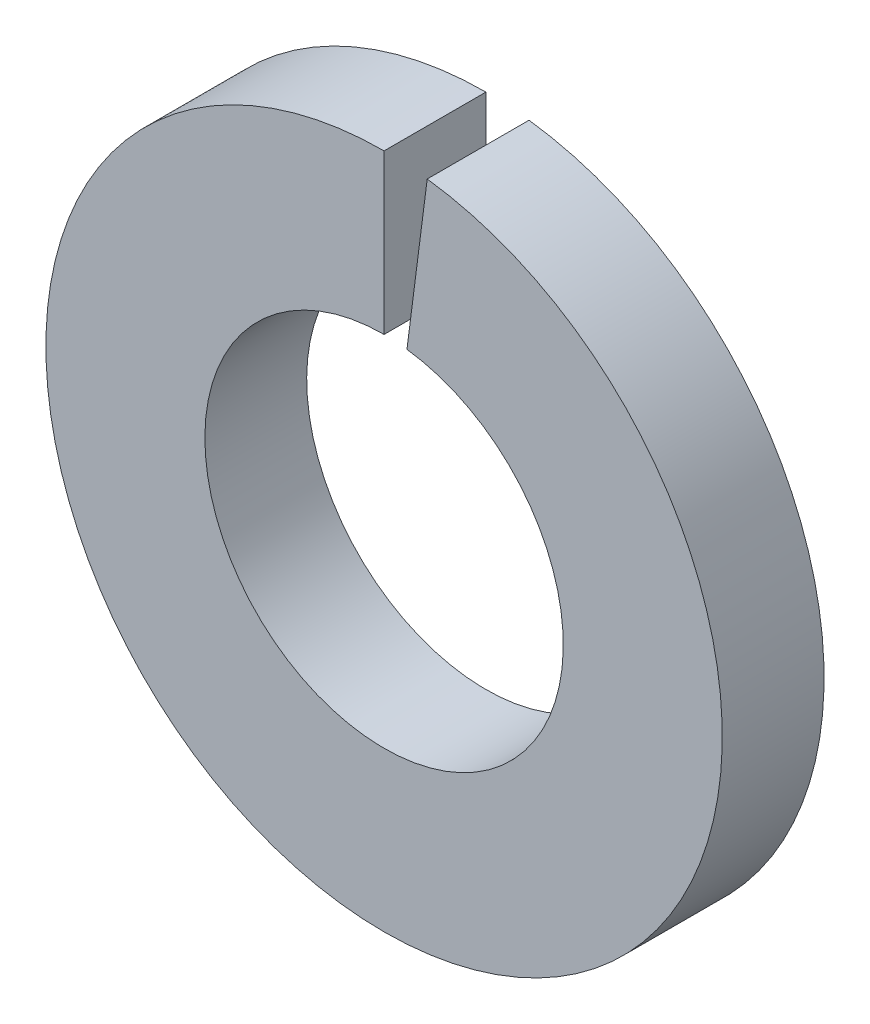
ISO-10303-21;
HEADER;
FILE_DESCRIPTION(('STEP AP214'),'2;1');
FILE_NAME('part.step','',(''),(''),'','','');
FILE_SCHEMA(('AUTOMOTIVE_DESIGN { 1 0 10303 214 1 1 1 1 }'));
ENDSEC;
DATA;
#1=APPLICATION_CONTEXT('core data for automotive mechanical design processes');
#2=APPLICATION_PROTOCOL_DEFINITION('international standard','automotive_design',2000,#1);
#3=PRODUCT_CONTEXT('',#1,'mechanical');
#4=PRODUCT('Part','Part','',(#3));
#5=PRODUCT_RELATED_PRODUCT_CATEGORY('part','',(#4));
#6=PRODUCT_DEFINITION_FORMATION('','',#4);
#7=PRODUCT_DEFINITION_CONTEXT('part definition',#1,'design');
#8=PRODUCT_DEFINITION('design','',#6,#7);
#9=PRODUCT_DEFINITION_SHAPE('','',#8);
#10=(LENGTH_UNIT() NAMED_UNIT(*) SI_UNIT(.MILLI.,.METRE.));
#11=(NAMED_UNIT(*) PLANE_ANGLE_UNIT() SI_UNIT($,.RADIAN.));
#12=(NAMED_UNIT(*) SI_UNIT($,.STERADIAN.) SOLID_ANGLE_UNIT());
#13=UNCERTAINTY_MEASURE_WITH_UNIT(LENGTH_MEASURE(1.E-05),#10,'distance_accuracy_value','');
#14=(GEOMETRIC_REPRESENTATION_CONTEXT(3) GLOBAL_UNCERTAINTY_ASSIGNED_CONTEXT((#13)) GLOBAL_UNIT_ASSIGNED_CONTEXT((#10,
#11,#12)) REPRESENTATION_CONTEXT('',''));
#15=CARTESIAN_POINT('',(0.,0.,0.));
#16=DIRECTION('',(0.,0.,1.));
#17=DIRECTION('',(1.,0.,0.));
#18=AXIS2_PLACEMENT_3D('',#15,#16,#17);
#19=CARTESIAN_POINT('',(0.,0.,1.8542));
#20=DIRECTION('',(0.,0.,1.));
#21=DIRECTION('',(1.,0.,0.));
#22=AXIS2_PLACEMENT_3D('',#19,#20,#21);
#23=PLANE('',#22);
#24=DIRECTION('',(0.127599136443187,0.991825821593163,0.));
#25=VECTOR('',#24,1.);
#26=CARTESIAN_POINT('',(0.,0.,1.8542));
#27=LINE('',#26,#25);
#28=CARTESIAN_POINT('',(0.416470821436917,3.23722029909792,1.8542));
#29=VERTEX_POINT('',#28);
#30=CARTESIAN_POINT('',(0.785946880921808,6.10915114810309,1.8542));
#31=VERTEX_POINT('',#30);
#32=EDGE_CURVE('E80',#29,#31,#27,.T.);
#33=ORIENTED_EDGE('',*,*,#32,.F.);
#34=CARTESIAN_POINT('',(0.,0.,1.8542));
#35=DIRECTION('',(0.,0.,1.));
#36=DIRECTION('',(1.,0.,0.));
#37=AXIS2_PLACEMENT_3D('',#34,#35,#36);
#38=CIRCLE('',#37,3.2639);
#39=CARTESIAN_POINT('',(0.,3.2639,1.8542));
#40=VERTEX_POINT('',#39);
#41=EDGE_CURVE('E99',#40,#29,#38,.T.);
#42=ORIENTED_EDGE('',*,*,#41,.F.);
#43=DIRECTION('',(0.,-1.,0.));
#44=VECTOR('',#43,1.);
#45=CARTESIAN_POINT('',(0.,0.,1.8542));
#46=LINE('',#45,#44);
#47=CARTESIAN_POINT('',(0.,6.1595,1.8542));
#48=VERTEX_POINT('',#47);
#49=EDGE_CURVE('E61',#48,#40,#46,.T.);
#50=ORIENTED_EDGE('',*,*,#49,.F.);
#51=CARTESIAN_POINT('',(0.,0.,1.8542));
#52=DIRECTION('',(0.,0.,1.));
#53=DIRECTION('',(1.,0.,0.));
#54=AXIS2_PLACEMENT_3D('',#51,#52,#53);
#55=CIRCLE('',#54,6.1595);
#56=EDGE_CURVE('E98',#48,#31,#55,.T.);
#57=ORIENTED_EDGE('',*,*,#56,.T.);
#58=EDGE_LOOP('',(#33,#42,#50,#57));
#59=FACE_BOUND('',#58,.T.);
#60=ADVANCED_FACE('F39',(#59),#23,.T.);
#61=CARTESIAN_POINT('',(0.,0.,0.));
#62=DIRECTION('',(0.,0.,1.));
#63=DIRECTION('',(1.,0.,0.));
#64=AXIS2_PLACEMENT_3D('',#61,#62,#63);
#65=PLANE('',#64);
#66=CARTESIAN_POINT('',(0.,0.,0.));
#67=DIRECTION('',(0.,0.,1.));
#68=DIRECTION('',(1.,0.,0.));
#69=AXIS2_PLACEMENT_3D('',#66,#67,#68);
#70=CIRCLE('',#69,3.2639);
#71=CARTESIAN_POINT('',(0.,3.2639,0.));
#72=VERTEX_POINT('',#71);
#73=CARTESIAN_POINT('',(0.416470821436917,3.23722029909793,0.));
#74=VERTEX_POINT('',#73);
#75=EDGE_CURVE('E95',#72,#74,#70,.T.);
#76=ORIENTED_EDGE('',*,*,#75,.T.);
#77=DIRECTION('',(0.127599136443187,0.991825821593163,0.));
#78=VECTOR('',#77,1.);
#79=CARTESIAN_POINT('',(0.,0.,0.));
#80=LINE('',#79,#78);
#81=CARTESIAN_POINT('',(0.785946880921808,6.10915114810309,0.));
#82=VERTEX_POINT('',#81);
#83=EDGE_CURVE('E53',#74,#82,#80,.T.);
#84=ORIENTED_EDGE('',*,*,#83,.T.);
#85=CARTESIAN_POINT('',(0.,0.,0.));
#86=DIRECTION('',(0.,0.,1.));
#87=DIRECTION('',(1.,0.,0.));
#88=AXIS2_PLACEMENT_3D('',#85,#86,#87);
#89=CIRCLE('',#88,6.1595);
#90=CARTESIAN_POINT('',(0.,6.1595,0.));
#91=VERTEX_POINT('',#90);
#92=EDGE_CURVE('E93',#91,#82,#89,.T.);
#93=ORIENTED_EDGE('',*,*,#92,.F.);
#94=DIRECTION('',(0.,-1.,0.));
#95=VECTOR('',#94,1.);
#96=CARTESIAN_POINT('',(0.,0.,0.));
#97=LINE('',#96,#95);
#98=EDGE_CURVE('E86',#91,#72,#97,.T.);
#99=ORIENTED_EDGE('',*,*,#98,.T.);
#100=EDGE_LOOP('',(#76,#84,#93,#99));
#101=FACE_BOUND('',#100,.T.);
#102=ADVANCED_FACE('F91',(#101),#65,.F.);
#103=CARTESIAN_POINT('',(0.,0.,1.8542));
#104=DIRECTION('',(0.,0.,-1.));
#105=DIRECTION('',(-1.,0.,0.));
#106=AXIS2_PLACEMENT_3D('',#103,#104,#105);
#107=CYLINDRICAL_SURFACE('',#106,6.1595);
#108=ORIENTED_EDGE('',*,*,#92,.T.);
#109=DIRECTION('',(0.,0.,1.));
#110=VECTOR('',#109,1.);
#111=CARTESIAN_POINT('',(0.785946880921808,6.10915114810309,0.));
#112=LINE('',#111,#110);
#113=EDGE_CURVE('E77',#82,#31,#112,.T.);
#114=ORIENTED_EDGE('',*,*,#113,.T.);
#115=ORIENTED_EDGE('',*,*,#56,.F.);
#116=DIRECTION('',(0.,0.,1.));
#117=VECTOR('',#116,1.);
#118=CARTESIAN_POINT('',(0.,6.1595,0.));
#119=LINE('',#118,#117);
#120=EDGE_CURVE('E85',#91,#48,#119,.T.);
#121=ORIENTED_EDGE('',*,*,#120,.F.);
#122=EDGE_LOOP('',(#108,#114,#115,#121));
#123=FACE_BOUND('',#122,.T.);
#124=ADVANCED_FACE('F41',(#123),#107,.T.);
#125=CARTESIAN_POINT('',(0.,0.,1.8542));
#126=DIRECTION('',(0.,0.,-1.));
#127=DIRECTION('',(-1.,0.,0.));
#128=AXIS2_PLACEMENT_3D('',#125,#126,#127);
#129=CYLINDRICAL_SURFACE('',#128,3.2639);
#130=DIRECTION('',(0.,0.,-1.));
#131=VECTOR('',#130,1.);
#132=CARTESIAN_POINT('',(0.416470821436917,3.23722029909793,1.8542));
#133=LINE('',#132,#131);
#134=EDGE_CURVE('E11',#74,#29,#133,.F.);
#135=ORIENTED_EDGE('',*,*,#134,.F.);
#136=ORIENTED_EDGE('',*,*,#75,.F.);
#137=DIRECTION('',(0.,0.,-1.));
#138=VECTOR('',#137,1.);
#139=CARTESIAN_POINT('',(0.,3.2639,1.8542));
#140=LINE('',#139,#138);
#141=EDGE_CURVE('E47',#40,#72,#140,.T.);
#142=ORIENTED_EDGE('',*,*,#141,.F.);
#143=ORIENTED_EDGE('',*,*,#41,.T.);
#144=EDGE_LOOP('',(#135,#136,#142,#143));
#145=FACE_BOUND('',#144,.T.);
#146=ADVANCED_FACE('F109',(#145),#129,.F.);
#147=CARTESIAN_POINT('',(0.,0.,0.));
#148=DIRECTION('',(-1.,0.,0.));
#149=DIRECTION('',(0.,0.,1.));
#150=AXIS2_PLACEMENT_3D('',#147,#148,#149);
#151=PLANE('',#150);
#152=ORIENTED_EDGE('',*,*,#141,.T.);
#153=ORIENTED_EDGE('',*,*,#98,.F.);
#154=ORIENTED_EDGE('',*,*,#120,.T.);
#155=ORIENTED_EDGE('',*,*,#49,.T.);
#156=EDGE_LOOP('',(#152,#153,#154,#155));
#157=FACE_BOUND('',#156,.T.);
#158=ADVANCED_FACE('F105',(#157),#151,.F.);
#159=CARTESIAN_POINT('',(0.,0.,0.));
#160=DIRECTION('',(0.991825821593163,-0.127599136443187,0.));
#161=DIRECTION('',(0.127599136443187,0.991825821593163,0.));
#162=AXIS2_PLACEMENT_3D('',#159,#160,#161);
#163=PLANE('',#162);
#164=ORIENTED_EDGE('',*,*,#134,.T.);
#165=ORIENTED_EDGE('',*,*,#32,.T.);
#166=ORIENTED_EDGE('',*,*,#113,.F.);
#167=ORIENTED_EDGE('',*,*,#83,.F.);
#168=EDGE_LOOP('',(#164,#165,#166,#167));
#169=FACE_BOUND('',#168,.T.);
#170=ADVANCED_FACE('F78',(#169),#163,.F.);
#171=CLOSED_SHELL('',(#60,#102,#124,#146,#158,#170));
#172=MANIFOLD_SOLID_BREP('B2',#171);
#173=ADVANCED_BREP_SHAPE_REPRESENTATION('',(#18,#172),#14);
#174=SHAPE_DEFINITION_REPRESENTATION(#9,#173);
ENDSEC;
END-ISO-10303-21;
